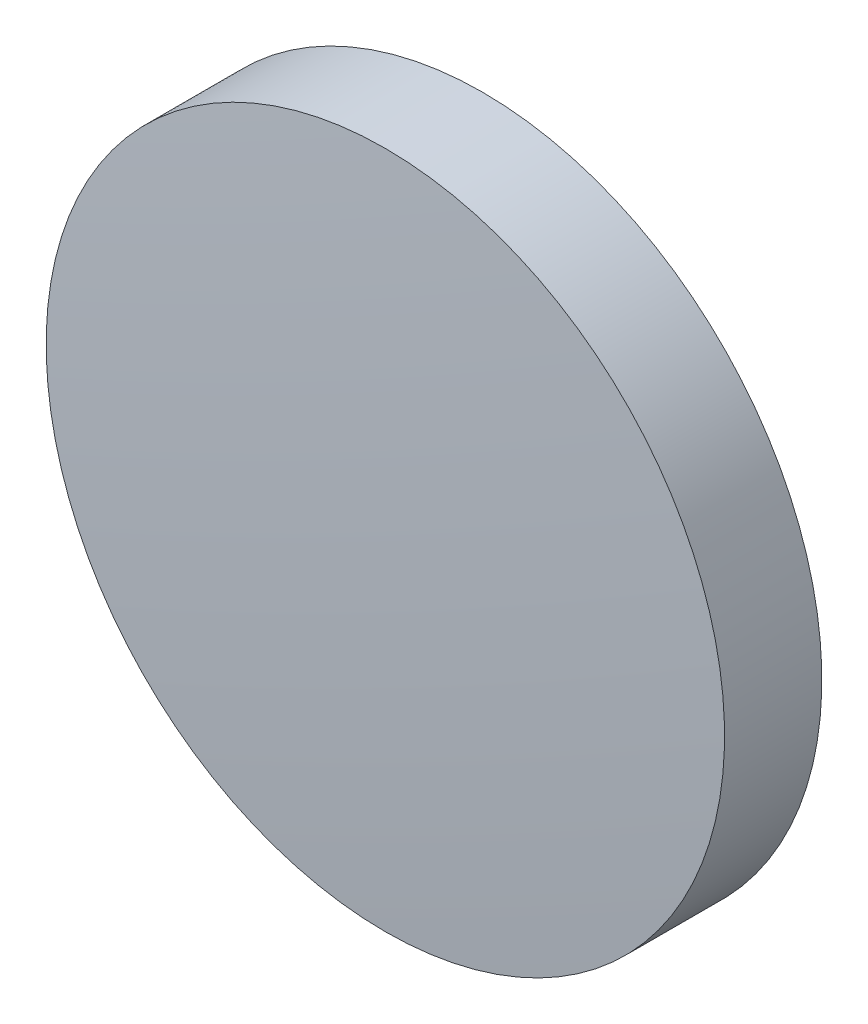
ISO-10303-21;
HEADER;
FILE_DESCRIPTION(('STEP AP214'),'2;1');
FILE_NAME('part.step','',(''),(''),'','','');
FILE_SCHEMA(('AUTOMOTIVE_DESIGN { 1 0 10303 214 1 1 1 1 }'));
ENDSEC;
DATA;
#1=APPLICATION_CONTEXT('core data for automotive mechanical design processes');
#2=APPLICATION_PROTOCOL_DEFINITION('international standard','automotive_design',2000,#1);
#3=PRODUCT_CONTEXT('',#1,'mechanical');
#4=PRODUCT('Part','Part','',(#3));
#5=PRODUCT_RELATED_PRODUCT_CATEGORY('part','',(#4));
#6=PRODUCT_DEFINITION_FORMATION('','',#4);
#7=PRODUCT_DEFINITION_CONTEXT('part definition',#1,'design');
#8=PRODUCT_DEFINITION('design','',#6,#7);
#9=PRODUCT_DEFINITION_SHAPE('','',#8);
#10=(LENGTH_UNIT() NAMED_UNIT(*) SI_UNIT(.MILLI.,.METRE.));
#11=(NAMED_UNIT(*) PLANE_ANGLE_UNIT() SI_UNIT($,.RADIAN.));
#12=(NAMED_UNIT(*) SI_UNIT($,.STERADIAN.) SOLID_ANGLE_UNIT());
#13=UNCERTAINTY_MEASURE_WITH_UNIT(LENGTH_MEASURE(1.E-05),#10,'distance_accuracy_value','');
#14=(GEOMETRIC_REPRESENTATION_CONTEXT(3) GLOBAL_UNCERTAINTY_ASSIGNED_CONTEXT((#13)) GLOBAL_UNIT_ASSIGNED_CONTEXT((#10,
#11,#12)) REPRESENTATION_CONTEXT('',''));
#15=CARTESIAN_POINT('',(0.,0.,0.));
#16=DIRECTION('',(0.,0.,1.));
#17=DIRECTION('',(1.,0.,0.));
#18=AXIS2_PLACEMENT_3D('',#15,#16,#17);
#19=CARTESIAN_POINT('',(0.,0.,-2.));
#20=DIRECTION('',(0.,0.,-1.));
#21=DIRECTION('',(0.,1.,0.));
#22=AXIS2_PLACEMENT_3D('',#19,#20,#21);
#23=PLANE('',#22);
#24=CARTESIAN_POINT('',(0.,0.,-2.));
#25=DIRECTION('',(0.,0.,-1.));
#26=DIRECTION('',(0.,1.,0.));
#27=AXIS2_PLACEMENT_3D('',#24,#25,#26);
#28=CIRCLE('',#27,12.7);
#29=CARTESIAN_POINT('',(0.,12.7,-2.));
#30=VERTEX_POINT('',#29);
#31=EDGE_CURVE('E36',#30,#30,#28,.T.);
#32=ORIENTED_EDGE('',*,*,#31,.T.);
#33=EDGE_LOOP('',(#32));
#34=FACE_BOUND('',#33,.T.);
#35=ADVANCED_FACE('F30',(#34),#23,.T.);
#36=CARTESIAN_POINT('',(0.,0.,-223.51));
#37=DIRECTION('',(0.,0.,-1.));
#38=DIRECTION('',(0.,1.,0.));
#39=AXIS2_PLACEMENT_3D('',#36,#37,#38);
#40=SPHERICAL_SURFACE('',#39,225.51);
#41=CARTESIAN_POINT('',(0.,0.,1.64210436502698));
#42=DIRECTION('',(0.,0.,-1.));
#43=DIRECTION('',(0.,1.,0.));
#44=AXIS2_PLACEMENT_3D('',#41,#42,#43);
#45=CIRCLE('',#44,12.7);
#46=CARTESIAN_POINT('',(0.,12.7,1.64210436502699));
#47=VERTEX_POINT('',#46);
#48=EDGE_CURVE('E10',#47,#47,#45,.T.);
#49=ORIENTED_EDGE('',*,*,#48,.F.);
#50=EDGE_LOOP('',(#49));
#51=FACE_BOUND('',#50,.T.);
#52=ADVANCED_FACE('F45',(#51),#40,.T.);
#53=CARTESIAN_POINT('',(0.,0.,-2.));
#54=DIRECTION('',(0.,0.,-1.));
#55=DIRECTION('',(0.,1.,0.));
#56=AXIS2_PLACEMENT_3D('',#53,#54,#55);
#57=CYLINDRICAL_SURFACE('',#56,12.7);
#58=ORIENTED_EDGE('',*,*,#48,.T.);
#59=EDGE_LOOP('',(#58));
#60=FACE_BOUND('',#59,.T.);
#61=ORIENTED_EDGE('',*,*,#31,.F.);
#62=EDGE_LOOP('',(#61));
#63=FACE_BOUND('',#62,.T.);
#64=ADVANCED_FACE('F43',(#60,#63),#57,.T.);
#65=CLOSED_SHELL('',(#35,#52,#64));
#66=MANIFOLD_SOLID_BREP('B2',#65);
#67=ADVANCED_BREP_SHAPE_REPRESENTATION('',(#18,#66),#14);
#68=SHAPE_DEFINITION_REPRESENTATION(#9,#67);
ENDSEC;
END-ISO-10303-21;
